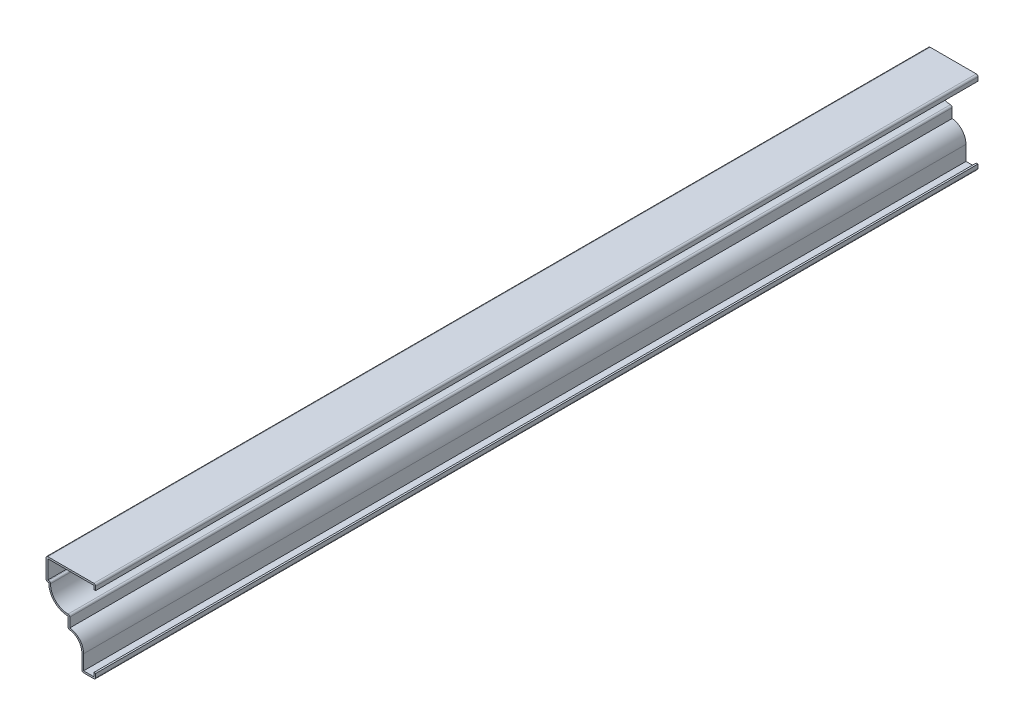
ISO-10303-21;
HEADER;
FILE_DESCRIPTION(('STEP AP214'),'2;1');
FILE_NAME('part.step','',(''),(''),'','','');
FILE_SCHEMA(('AUTOMOTIVE_DESIGN { 1 0 10303 214 1 1 1 1 }'));
ENDSEC;
DATA;
#1=APPLICATION_CONTEXT('core data for automotive mechanical design processes');
#2=APPLICATION_PROTOCOL_DEFINITION('international standard','automotive_design',2000,#1);
#3=PRODUCT_CONTEXT('',#1,'mechanical');
#4=PRODUCT('Part','Part','',(#3));
#5=PRODUCT_RELATED_PRODUCT_CATEGORY('part','',(#4));
#6=PRODUCT_DEFINITION_FORMATION('','',#4);
#7=PRODUCT_DEFINITION_CONTEXT('part definition',#1,'design');
#8=PRODUCT_DEFINITION('design','',#6,#7);
#9=PRODUCT_DEFINITION_SHAPE('','',#8);
#10=(LENGTH_UNIT() NAMED_UNIT(*) SI_UNIT(.MILLI.,.METRE.));
#11=(NAMED_UNIT(*) PLANE_ANGLE_UNIT() SI_UNIT($,.RADIAN.));
#12=(NAMED_UNIT(*) SI_UNIT($,.STERADIAN.) SOLID_ANGLE_UNIT());
#13=UNCERTAINTY_MEASURE_WITH_UNIT(LENGTH_MEASURE(1.E-05),#10,'distance_accuracy_value','');
#14=(GEOMETRIC_REPRESENTATION_CONTEXT(3) GLOBAL_UNCERTAINTY_ASSIGNED_CONTEXT((#13)) GLOBAL_UNIT_ASSIGNED_CONTEXT((#10,
#11,#12)) REPRESENTATION_CONTEXT('',''));
#15=CARTESIAN_POINT('',(0.,0.,0.));
#16=DIRECTION('',(0.,0.,1.));
#17=DIRECTION('',(1.,0.,0.));
#18=AXIS2_PLACEMENT_3D('',#15,#16,#17);
#19=CARTESIAN_POINT('',(-1.016,47.625,-508.));
#20=DIRECTION('',(-1.,0.,0.));
#21=DIRECTION('',(0.,-1.,0.));
#22=AXIS2_PLACEMENT_3D('',#19,#20,#21);
#23=PLANE('',#22);
#24=DIRECTION('',(0.,-1.,0.));
#25=VECTOR('',#24,1.);
#26=CARTESIAN_POINT('',(-1.016,47.625,0.));
#27=LINE('',#26,#25);
#28=CARTESIAN_POINT('',(-1.016,46.609,0.));
#29=VERTEX_POINT('',#28);
#30=CARTESIAN_POINT('',(-1.016,44.45,0.));
#31=VERTEX_POINT('',#30);
#32=EDGE_CURVE('E312',#29,#31,#27,.T.);
#33=ORIENTED_EDGE('',*,*,#32,.F.);
#34=DIRECTION('',(0.,0.,1.));
#35=VECTOR('',#34,1.);
#36=CARTESIAN_POINT('',(-1.016,46.609,-508.));
#37=LINE('',#36,#35);
#38=CARTESIAN_POINT('',(-1.016,46.609,-508.));
#39=VERTEX_POINT('',#38);
#40=EDGE_CURVE('E257',#39,#29,#37,.T.);
#41=ORIENTED_EDGE('',*,*,#40,.F.);
#42=DIRECTION('',(0.,-1.,0.));
#43=VECTOR('',#42,1.);
#44=CARTESIAN_POINT('',(-1.016,47.625,-508.));
#45=LINE('',#44,#43);
#46=CARTESIAN_POINT('',(-1.016,44.45,-508.));
#47=VERTEX_POINT('',#46);
#48=EDGE_CURVE('E238',#39,#47,#45,.T.);
#49=ORIENTED_EDGE('',*,*,#48,.T.);
#50=DIRECTION('',(0.,0.,1.));
#51=VECTOR('',#50,1.);
#52=CARTESIAN_POINT('',(-1.016,44.45,-508.));
#53=LINE('',#52,#51);
#54=EDGE_CURVE('E247',#47,#31,#53,.T.);
#55=ORIENTED_EDGE('',*,*,#54,.T.);
#56=EDGE_LOOP('',(#33,#41,#49,#55));
#57=FACE_BOUND('',#56,.T.);
#58=ADVANCED_FACE('F35',(#57),#23,.T.);
#59=CARTESIAN_POINT('',(-28.575,46.609,-508.));
#60=DIRECTION('',(0.,-1.,0.));
#61=DIRECTION('',(0.,0.,-1.));
#62=AXIS2_PLACEMENT_3D('',#59,#60,#61);
#63=PLANE('',#62);
#64=DIRECTION('',(1.,0.,0.));
#65=VECTOR('',#64,1.);
#66=CARTESIAN_POINT('',(-28.575,46.609,0.));
#67=LINE('',#66,#65);
#68=CARTESIAN_POINT('',(-27.559,46.609,0.));
#69=VERTEX_POINT('',#68);
#70=EDGE_CURVE('E258',#69,#29,#67,.T.);
#71=ORIENTED_EDGE('',*,*,#70,.F.);
#72=DIRECTION('',(0.,0.,1.));
#73=VECTOR('',#72,1.);
#74=CARTESIAN_POINT('',(-27.559,46.609,-508.));
#75=LINE('',#74,#73);
#76=CARTESIAN_POINT('',(-27.559,46.609,-508.));
#77=VERTEX_POINT('',#76);
#78=EDGE_CURVE('E366',#77,#69,#75,.T.);
#79=ORIENTED_EDGE('',*,*,#78,.F.);
#80=DIRECTION('',(1.,0.,0.));
#81=VECTOR('',#80,1.);
#82=CARTESIAN_POINT('',(-28.575,46.609,-508.));
#83=LINE('',#82,#81);
#84=EDGE_CURVE('E255',#77,#39,#83,.T.);
#85=ORIENTED_EDGE('',*,*,#84,.T.);
#86=ORIENTED_EDGE('',*,*,#40,.T.);
#87=EDGE_LOOP('',(#71,#79,#85,#86));
#88=FACE_BOUND('',#87,.T.);
#89=ADVANCED_FACE('F523',(#88),#63,.T.);
#90=CARTESIAN_POINT('',(-27.559,34.925,-508.));
#91=DIRECTION('',(1.,0.,0.));
#92=DIRECTION('',(0.,0.,-1.));
#93=AXIS2_PLACEMENT_3D('',#90,#91,#92);
#94=PLANE('',#93);
#95=DIRECTION('',(0.,1.,0.));
#96=VECTOR('',#95,1.);
#97=CARTESIAN_POINT('',(-27.559,34.925,0.));
#98=LINE('',#97,#96);
#99=CARTESIAN_POINT('',(-27.559,35.941,0.));
#100=VERTEX_POINT('',#99);
#101=EDGE_CURVE('E261',#100,#69,#98,.T.);
#102=ORIENTED_EDGE('',*,*,#101,.F.);
#103=DIRECTION('',(0.,0.,1.));
#104=VECTOR('',#103,1.);
#105=CARTESIAN_POINT('',(-27.559,35.941,-508.));
#106=LINE('',#105,#104);
#107=CARTESIAN_POINT('',(-27.559,35.941,-508.));
#108=VERTEX_POINT('',#107);
#109=EDGE_CURVE('E368',#108,#100,#106,.T.);
#110=ORIENTED_EDGE('',*,*,#109,.F.);
#111=DIRECTION('',(0.,1.,0.));
#112=VECTOR('',#111,1.);
#113=CARTESIAN_POINT('',(-27.559,34.925,-508.));
#114=LINE('',#113,#112);
#115=EDGE_CURVE('E308',#108,#77,#114,.T.);
#116=ORIENTED_EDGE('',*,*,#115,.T.);
#117=ORIENTED_EDGE('',*,*,#78,.T.);
#118=EDGE_LOOP('',(#102,#110,#116,#117));
#119=FACE_BOUND('',#118,.T.);
#120=ADVANCED_FACE('F529',(#119),#94,.T.);
#121=CARTESIAN_POINT('',(-26.9875,35.941,-508.));
#122=DIRECTION('',(0.,1.,0.));
#123=DIRECTION('',(0.,0.,1.));
#124=AXIS2_PLACEMENT_3D('',#121,#122,#123);
#125=PLANE('',#124);
#126=DIRECTION('',(1.,0.,0.));
#127=VECTOR('',#126,1.);
#128=CARTESIAN_POINT('',(-26.9875,35.941,0.));
#129=LINE('',#128,#127);
#130=CARTESIAN_POINT('',(-26.9875,35.941,0.));
#131=VERTEX_POINT('',#130);
#132=EDGE_CURVE('E360',#131,#100,#129,.F.);
#133=ORIENTED_EDGE('',*,*,#132,.F.);
#134=DIRECTION('',(0.,0.,1.));
#135=VECTOR('',#134,1.);
#136=CARTESIAN_POINT('',(-26.9875,35.941,-508.));
#137=LINE('',#136,#135);
#138=CARTESIAN_POINT('',(-26.9875,35.941,-508.));
#139=VERTEX_POINT('',#138);
#140=EDGE_CURVE('E441',#131,#139,#137,.F.);
#141=ORIENTED_EDGE('',*,*,#140,.T.);
#142=DIRECTION('',(1.,0.,0.));
#143=VECTOR('',#142,1.);
#144=CARTESIAN_POINT('',(-26.9875,35.941,-508.));
#145=LINE('',#144,#143);
#146=EDGE_CURVE('E306',#139,#108,#145,.F.);
#147=ORIENTED_EDGE('',*,*,#146,.T.);
#148=ORIENTED_EDGE('',*,*,#109,.T.);
#149=EDGE_LOOP('',(#133,#141,#147,#148));
#150=FACE_BOUND('',#149,.T.);
#151=ADVANCED_FACE('F532',(#150),#125,.T.);
#152=CARTESIAN_POINT('',(-15.875,34.925,-508.));
#153=DIRECTION('',(0.,0.,1.));
#154=DIRECTION('',(1.,0.,0.));
#155=AXIS2_PLACEMENT_3D('',#152,#153,#154);
#156=CYLINDRICAL_SURFACE('',#155,10.0965);
#157=CARTESIAN_POINT('',(-15.875,34.925,-508.));
#158=DIRECTION('',(0.,0.,1.));
#159=DIRECTION('',(1.,0.,0.));
#160=AXIS2_PLACEMENT_3D('',#157,#158,#159);
#161=CIRCLE('',#160,10.0965);
#162=CARTESIAN_POINT('',(-15.875,24.8285,-508.));
#163=VERTEX_POINT('',#162);
#164=CARTESIAN_POINT('',(-25.9715,34.925,-508.));
#165=VERTEX_POINT('',#164);
#166=EDGE_CURVE('E303',#163,#165,#161,.F.);
#167=ORIENTED_EDGE('',*,*,#166,.T.);
#168=DIRECTION('',(0.,0.,1.));
#169=VECTOR('',#168,1.);
#170=CARTESIAN_POINT('',(-25.9715,34.925,-508.));
#171=LINE('',#170,#169);
#172=CARTESIAN_POINT('',(-25.9715,34.925,0.));
#173=VERTEX_POINT('',#172);
#174=EDGE_CURVE('E438',#165,#173,#171,.T.);
#175=ORIENTED_EDGE('',*,*,#174,.T.);
#176=CARTESIAN_POINT('',(-15.875,34.925,0.));
#177=DIRECTION('',(0.,0.,1.));
#178=DIRECTION('',(1.,0.,0.));
#179=AXIS2_PLACEMENT_3D('',#176,#177,#178);
#180=CIRCLE('',#179,10.0965);
#181=CARTESIAN_POINT('',(-15.875,24.8285,0.));
#182=VERTEX_POINT('',#181);
#183=EDGE_CURVE('E357',#182,#173,#180,.F.);
#184=ORIENTED_EDGE('',*,*,#183,.F.);
#185=DIRECTION('',(0.,0.,1.));
#186=VECTOR('',#185,1.);
#187=CARTESIAN_POINT('',(-15.875,24.8285,-508.));
#188=LINE('',#187,#186);
#189=EDGE_CURVE('E436',#182,#163,#188,.F.);
#190=ORIENTED_EDGE('',*,*,#189,.T.);
#191=EDGE_LOOP('',(#167,#175,#184,#190));
#192=FACE_BOUND('',#191,.T.);
#193=ADVANCED_FACE('F540',(#192),#156,.F.);
#194=CARTESIAN_POINT('',(-14.859,17.4625,-508.));
#195=DIRECTION('',(1.,0.,0.));
#196=DIRECTION('',(0.,0.,-1.));
#197=AXIS2_PLACEMENT_3D('',#194,#195,#196);
#198=PLANE('',#197);
#199=DIRECTION('',(0.,1.,0.));
#200=VECTOR('',#199,1.);
#201=CARTESIAN_POINT('',(-14.859,17.4625,-508.));
#202=LINE('',#201,#200);
#203=CARTESIAN_POINT('',(-14.859,18.4206678360874,-508.));
#204=VERTEX_POINT('',#203);
#205=CARTESIAN_POINT('',(-14.859,23.8125,-508.));
#206=VERTEX_POINT('',#205);
#207=EDGE_CURVE('E300',#204,#206,#202,.T.);
#208=ORIENTED_EDGE('',*,*,#207,.T.);
#209=DIRECTION('',(0.,0.,1.));
#210=VECTOR('',#209,1.);
#211=CARTESIAN_POINT('',(-14.859,23.8125,-508.));
#212=LINE('',#211,#210);
#213=CARTESIAN_POINT('',(-14.859,23.8125,0.));
#214=VERTEX_POINT('',#213);
#215=EDGE_CURVE('E445',#206,#214,#212,.T.);
#216=ORIENTED_EDGE('',*,*,#215,.T.);
#217=DIRECTION('',(0.,1.,0.));
#218=VECTOR('',#217,1.);
#219=CARTESIAN_POINT('',(-14.859,17.4625,0.));
#220=LINE('',#219,#218);
#221=CARTESIAN_POINT('',(-14.859,18.4206678360874,0.));
#222=VERTEX_POINT('',#221);
#223=EDGE_CURVE('E354',#222,#214,#220,.T.);
#224=ORIENTED_EDGE('',*,*,#223,.F.);
#225=DIRECTION('',(0.,0.,1.));
#226=VECTOR('',#225,1.);
#227=CARTESIAN_POINT('',(-14.859,18.4206678360874,-508.));
#228=LINE('',#227,#226);
#229=EDGE_CURVE('E371',#204,#222,#228,.T.);
#230=ORIENTED_EDGE('',*,*,#229,.F.);
#231=EDGE_LOOP('',(#208,#216,#224,#230));
#232=FACE_BOUND('',#231,.T.);
#233=ADVANCED_FACE('F549',(#232),#198,.T.);
#234=CARTESIAN_POINT('',(-15.875,9.52500000000001,-508.));
#235=DIRECTION('',(0.,0.,1.));
#236=DIRECTION('',(1.,0.,0.));
#237=AXIS2_PLACEMENT_3D('',#234,#235,#236);
#238=CYLINDRICAL_SURFACE('',#237,8.9535);
#239=CARTESIAN_POINT('',(-15.875,9.52500000000001,0.));
#240=DIRECTION('',(0.,0.,1.));
#241=DIRECTION('',(1.,0.,0.));
#242=AXIS2_PLACEMENT_3D('',#239,#240,#241);
#243=CIRCLE('',#242,8.9535);
#244=CARTESIAN_POINT('',(-6.9215,9.52500000000001,0.));
#245=VERTEX_POINT('',#244);
#246=EDGE_CURVE('E351',#245,#222,#243,.T.);
#247=ORIENTED_EDGE('',*,*,#246,.F.);
#248=DIRECTION('',(0.,0.,1.));
#249=VECTOR('',#248,1.);
#250=CARTESIAN_POINT('',(-6.9215,9.52500000000001,-508.));
#251=LINE('',#250,#249);
#252=CARTESIAN_POINT('',(-6.9215,9.52500000000001,-508.));
#253=VERTEX_POINT('',#252);
#254=EDGE_CURVE('E373',#253,#245,#251,.T.);
#255=ORIENTED_EDGE('',*,*,#254,.F.);
#256=CARTESIAN_POINT('',(-15.875,9.52500000000001,-508.));
#257=DIRECTION('',(0.,0.,1.));
#258=DIRECTION('',(1.,0.,0.));
#259=AXIS2_PLACEMENT_3D('',#256,#257,#258);
#260=CIRCLE('',#259,8.9535);
#261=EDGE_CURVE('E297',#253,#204,#260,.T.);
#262=ORIENTED_EDGE('',*,*,#261,.T.);
#263=ORIENTED_EDGE('',*,*,#229,.T.);
#264=EDGE_LOOP('',(#247,#255,#262,#263));
#265=FACE_BOUND('',#264,.T.);
#266=ADVANCED_FACE('F553',(#265),#238,.T.);
#267=CARTESIAN_POINT('',(-6.9215,0.,-508.));
#268=DIRECTION('',(1.,0.,0.));
#269=DIRECTION('',(0.,1.,0.));
#270=AXIS2_PLACEMENT_3D('',#267,#268,#269);
#271=PLANE('',#270);
#272=DIRECTION('',(0.,1.,0.));
#273=VECTOR('',#272,1.);
#274=CARTESIAN_POINT('',(-6.9215,0.,0.));
#275=LINE('',#274,#273);
#276=CARTESIAN_POINT('',(-6.9215,1.016,0.));
#277=VERTEX_POINT('',#276);
#278=EDGE_CURVE('E348',#277,#245,#275,.T.);
#279=ORIENTED_EDGE('',*,*,#278,.F.);
#280=DIRECTION('',(0.,0.,1.));
#281=VECTOR('',#280,1.);
#282=CARTESIAN_POINT('',(-6.9215,1.016,-508.));
#283=LINE('',#282,#281);
#284=CARTESIAN_POINT('',(-6.9215,1.016,-508.));
#285=VERTEX_POINT('',#284);
#286=EDGE_CURVE('E375',#285,#277,#283,.T.);
#287=ORIENTED_EDGE('',*,*,#286,.F.);
#288=DIRECTION('',(0.,1.,0.));
#289=VECTOR('',#288,1.);
#290=CARTESIAN_POINT('',(-6.9215,0.,-508.));
#291=LINE('',#290,#289);
#292=EDGE_CURVE('E294',#285,#253,#291,.T.);
#293=ORIENTED_EDGE('',*,*,#292,.T.);
#294=ORIENTED_EDGE('',*,*,#254,.T.);
#295=EDGE_LOOP('',(#279,#287,#293,#294));
#296=FACE_BOUND('',#295,.T.);
#297=ADVANCED_FACE('F558',(#296),#271,.T.);
#298=CARTESIAN_POINT('',(0.,1.016,-508.));
#299=DIRECTION('',(0.,1.,0.));
#300=DIRECTION('',(-1.,0.,0.));
#301=AXIS2_PLACEMENT_3D('',#298,#299,#300);
#302=PLANE('',#301);
#303=DIRECTION('',(-1.,0.,0.));
#304=VECTOR('',#303,1.);
#305=CARTESIAN_POINT('',(0.,1.016,0.));
#306=LINE('',#305,#304);
#307=CARTESIAN_POINT('',(-1.016,1.016,0.));
#308=VERTEX_POINT('',#307);
#309=EDGE_CURVE('E345',#308,#277,#306,.T.);
#310=ORIENTED_EDGE('',*,*,#309,.F.);
#311=DIRECTION('',(0.,0.,1.));
#312=VECTOR('',#311,1.);
#313=CARTESIAN_POINT('',(-1.016,1.016,-508.));
#314=LINE('',#313,#312);
#315=CARTESIAN_POINT('',(-1.016,1.016,-508.));
#316=VERTEX_POINT('',#315);
#317=EDGE_CURVE('E377',#316,#308,#314,.T.);
#318=ORIENTED_EDGE('',*,*,#317,.F.);
#319=DIRECTION('',(-1.,0.,0.));
#320=VECTOR('',#319,1.);
#321=CARTESIAN_POINT('',(0.,1.016,-508.));
#322=LINE('',#321,#320);
#323=EDGE_CURVE('E291',#316,#285,#322,.T.);
#324=ORIENTED_EDGE('',*,*,#323,.T.);
#325=ORIENTED_EDGE('',*,*,#286,.T.);
#326=EDGE_LOOP('',(#310,#318,#324,#325));
#327=FACE_BOUND('',#326,.T.);
#328=ADVANCED_FACE('F561',(#327),#302,.T.);
#329=CARTESIAN_POINT('',(-1.016,3.175,-508.));
#330=DIRECTION('',(-1.,0.,0.));
#331=DIRECTION('',(0.,0.,1.));
#332=AXIS2_PLACEMENT_3D('',#329,#330,#331);
#333=PLANE('',#332);
#334=DIRECTION('',(0.,1.,0.));
#335=VECTOR('',#334,1.);
#336=CARTESIAN_POINT('',(-1.016,3.175,0.));
#337=LINE('',#336,#335);
#338=CARTESIAN_POINT('',(-1.016,3.175,0.));
#339=VERTEX_POINT('',#338);
#340=EDGE_CURVE('E342',#339,#308,#337,.F.);
#341=ORIENTED_EDGE('',*,*,#340,.F.);
#342=DIRECTION('',(0.,0.,1.));
#343=VECTOR('',#342,1.);
#344=CARTESIAN_POINT('',(-1.016,3.175,-508.));
#345=LINE('',#344,#343);
#346=CARTESIAN_POINT('',(-1.016,3.175,-508.));
#347=VERTEX_POINT('',#346);
#348=EDGE_CURVE('E379',#347,#339,#345,.T.);
#349=ORIENTED_EDGE('',*,*,#348,.F.);
#350=DIRECTION('',(0.,1.,0.));
#351=VECTOR('',#350,1.);
#352=CARTESIAN_POINT('',(-1.016,3.175,-508.));
#353=LINE('',#352,#351);
#354=EDGE_CURVE('E288',#347,#316,#353,.F.);
#355=ORIENTED_EDGE('',*,*,#354,.T.);
#356=ORIENTED_EDGE('',*,*,#317,.T.);
#357=EDGE_LOOP('',(#341,#349,#355,#356));
#358=FACE_BOUND('',#357,.T.);
#359=ADVANCED_FACE('F565',(#358),#333,.T.);
#360=CARTESIAN_POINT('',(-1.016,3.175,-508.));
#361=DIRECTION('',(0.,-1.,0.));
#362=DIRECTION('',(0.,0.,-1.));
#363=AXIS2_PLACEMENT_3D('',#360,#361,#362);
#364=PLANE('',#363);
#365=DIRECTION('',(1.,0.,0.));
#366=VECTOR('',#365,1.);
#367=CARTESIAN_POINT('',(-1.016,3.175,0.));
#368=LINE('',#367,#366);
#369=CARTESIAN_POINT('',(0.,3.175,0.));
#370=VERTEX_POINT('',#369);
#371=EDGE_CURVE('E340',#339,#370,#368,.T.);
#372=ORIENTED_EDGE('',*,*,#371,.T.);
#373=DIRECTION('',(0.,0.,1.));
#374=VECTOR('',#373,1.);
#375=CARTESIAN_POINT('',(0.,3.175,-508.));
#376=LINE('',#375,#374);
#377=CARTESIAN_POINT('',(0.,3.175,-508.));
#378=VERTEX_POINT('',#377);
#379=EDGE_CURVE('E381',#378,#370,#376,.T.);
#380=ORIENTED_EDGE('',*,*,#379,.F.);
#381=DIRECTION('',(1.,0.,0.));
#382=VECTOR('',#381,1.);
#383=CARTESIAN_POINT('',(-1.016,3.175,-508.));
#384=LINE('',#383,#382);
#385=EDGE_CURVE('E286',#347,#378,#384,.T.);
#386=ORIENTED_EDGE('',*,*,#385,.F.);
#387=ORIENTED_EDGE('',*,*,#348,.T.);
#388=EDGE_LOOP('',(#372,#380,#386,#387));
#389=FACE_BOUND('',#388,.T.);
#390=ADVANCED_FACE('F570',(#389),#364,.F.);
#391=CARTESIAN_POINT('',(0.,3.175,-508.));
#392=DIRECTION('',(-1.,0.,0.));
#393=DIRECTION('',(0.,0.,1.));
#394=AXIS2_PLACEMENT_3D('',#391,#392,#393);
#395=PLANE('',#394);
#396=DIRECTION('',(0.,-1.,0.));
#397=VECTOR('',#396,1.);
#398=CARTESIAN_POINT('',(0.,3.175,0.));
#399=LINE('',#398,#397);
#400=CARTESIAN_POINT('',(0.,1.016,0.));
#401=VERTEX_POINT('',#400);
#402=EDGE_CURVE('E337',#370,#401,#399,.T.);
#403=ORIENTED_EDGE('',*,*,#402,.T.);
#404=DIRECTION('',(0.,0.,1.));
#405=VECTOR('',#404,1.);
#406=CARTESIAN_POINT('',(0.,1.016,-508.));
#407=LINE('',#406,#405);
#408=CARTESIAN_POINT('',(0.,1.016,-508.));
#409=VERTEX_POINT('',#408);
#410=EDGE_CURVE('E11',#401,#409,#407,.F.);
#411=ORIENTED_EDGE('',*,*,#410,.T.);
#412=DIRECTION('',(0.,-1.,0.));
#413=VECTOR('',#412,1.);
#414=CARTESIAN_POINT('',(0.,3.175,-508.));
#415=LINE('',#414,#413);
#416=EDGE_CURVE('E283',#378,#409,#415,.T.);
#417=ORIENTED_EDGE('',*,*,#416,.F.);
#418=ORIENTED_EDGE('',*,*,#379,.T.);
#419=EDGE_LOOP('',(#403,#411,#417,#418));
#420=FACE_BOUND('',#419,.T.);
#421=ADVANCED_FACE('F576',(#420),#395,.F.);
#422=CARTESIAN_POINT('',(0.,0.,-508.));
#423=DIRECTION('',(0.,1.,0.));
#424=DIRECTION('',(-1.,0.,0.));
#425=AXIS2_PLACEMENT_3D('',#422,#423,#424);
#426=PLANE('',#425);
#427=DIRECTION('',(-1.,0.,0.));
#428=VECTOR('',#427,1.);
#429=CARTESIAN_POINT('',(0.,0.,0.));
#430=LINE('',#429,#428);
#431=CARTESIAN_POINT('',(-1.016,0.,0.));
#432=VERTEX_POINT('',#431);
#433=CARTESIAN_POINT('',(-6.9215,0.,0.));
#434=VERTEX_POINT('',#433);
#435=EDGE_CURVE('E334',#432,#434,#430,.T.);
#436=ORIENTED_EDGE('',*,*,#435,.T.);
#437=DIRECTION('',(0.,0.,1.));
#438=VECTOR('',#437,1.);
#439=CARTESIAN_POINT('',(-6.9215,0.,-508.));
#440=LINE('',#439,#438);
#441=CARTESIAN_POINT('',(-6.9215,0.,-508.));
#442=VERTEX_POINT('',#441);
#443=EDGE_CURVE('E43',#434,#442,#440,.F.);
#444=ORIENTED_EDGE('',*,*,#443,.T.);
#445=DIRECTION('',(-1.,0.,0.));
#446=VECTOR('',#445,1.);
#447=CARTESIAN_POINT('',(0.,0.,-508.));
#448=LINE('',#447,#446);
#449=CARTESIAN_POINT('',(-1.016,0.,-508.));
#450=VERTEX_POINT('',#449);
#451=EDGE_CURVE('E280',#450,#442,#448,.T.);
#452=ORIENTED_EDGE('',*,*,#451,.F.);
#453=DIRECTION('',(0.,0.,1.));
#454=VECTOR('',#453,1.);
#455=CARTESIAN_POINT('',(-1.016,0.,-508.));
#456=LINE('',#455,#454);
#457=EDGE_CURVE('E456',#450,#432,#456,.T.);
#458=ORIENTED_EDGE('',*,*,#457,.T.);
#459=EDGE_LOOP('',(#436,#444,#452,#458));
#460=FACE_BOUND('',#459,.T.);
#461=ADVANCED_FACE('F461',(#460),#426,.F.);
#462=CARTESIAN_POINT('',(-7.9375,0.,-508.));
#463=DIRECTION('',(1.,0.,0.));
#464=DIRECTION('',(0.,1.,0.));
#465=AXIS2_PLACEMENT_3D('',#462,#463,#464);
#466=PLANE('',#465);
#467=DIRECTION('',(0.,1.,0.));
#468=VECTOR('',#467,1.);
#469=CARTESIAN_POINT('',(-7.9375,0.,-508.));
#470=LINE('',#469,#468);
#471=CARTESIAN_POINT('',(-7.9375,1.016,-508.));
#472=VERTEX_POINT('',#471);
#473=CARTESIAN_POINT('',(-7.9375,9.52500000000001,-508.));
#474=VERTEX_POINT('',#473);
#475=EDGE_CURVE('E278',#472,#474,#470,.T.);
#476=ORIENTED_EDGE('',*,*,#475,.F.);
#477=DIRECTION('',(0.,0.,1.));
#478=VECTOR('',#477,1.);
#479=CARTESIAN_POINT('',(-7.9375,1.016,-508.));
#480=LINE('',#479,#478);
#481=CARTESIAN_POINT('',(-7.9375,1.016,0.));
#482=VERTEX_POINT('',#481);
#483=EDGE_CURVE('E453',#472,#482,#480,.T.);
#484=ORIENTED_EDGE('',*,*,#483,.T.);
#485=DIRECTION('',(0.,1.,0.));
#486=VECTOR('',#485,1.);
#487=CARTESIAN_POINT('',(-7.9375,0.,0.));
#488=LINE('',#487,#486);
#489=CARTESIAN_POINT('',(-7.9375,9.52500000000001,0.));
#490=VERTEX_POINT('',#489);
#491=EDGE_CURVE('E332',#482,#490,#488,.T.);
#492=ORIENTED_EDGE('',*,*,#491,.T.);
#493=DIRECTION('',(0.,0.,1.));
#494=VECTOR('',#493,1.);
#495=CARTESIAN_POINT('',(-7.9375,9.52500000000001,-508.));
#496=LINE('',#495,#494);
#497=EDGE_CURVE('E384',#474,#490,#496,.T.);
#498=ORIENTED_EDGE('',*,*,#497,.F.);
#499=EDGE_LOOP('',(#476,#484,#492,#498));
#500=FACE_BOUND('',#499,.T.);
#501=ADVANCED_FACE('F472',(#500),#466,.F.);
#502=CARTESIAN_POINT('',(-15.875,9.52500000000001,-508.));
#503=DIRECTION('',(0.,0.,1.));
#504=DIRECTION('',(1.,0.,0.));
#505=AXIS2_PLACEMENT_3D('',#502,#503,#504);
#506=CYLINDRICAL_SURFACE('',#505,7.9375);
#507=CARTESIAN_POINT('',(-15.875,9.52500000000001,0.));
#508=DIRECTION('',(0.,0.,1.));
#509=DIRECTION('',(1.,0.,0.));
#510=AXIS2_PLACEMENT_3D('',#507,#508,#509);
#511=CIRCLE('',#510,7.9375);
#512=CARTESIAN_POINT('',(-14.9742907801418,17.4112303511413,0.));
#513=VERTEX_POINT('',#512);
#514=EDGE_CURVE('E329',#490,#513,#511,.T.);
#515=ORIENTED_EDGE('',*,*,#514,.T.);
#516=DIRECTION('',(0.,0.,1.));
#517=VECTOR('',#516,1.);
#518=CARTESIAN_POINT('',(-14.9742907801418,17.4112303511413,-508.));
#519=LINE('',#518,#517);
#520=CARTESIAN_POINT('',(-14.9742907801418,17.4112303511413,-508.));
#521=VERTEX_POINT('',#520);
#522=EDGE_CURVE('E451',#513,#521,#519,.F.);
#523=ORIENTED_EDGE('',*,*,#522,.T.);
#524=CARTESIAN_POINT('',(-15.875,9.52500000000001,-508.));
#525=DIRECTION('',(0.,0.,1.));
#526=DIRECTION('',(1.,0.,0.));
#527=AXIS2_PLACEMENT_3D('',#524,#525,#526);
#528=CIRCLE('',#527,7.9375);
#529=EDGE_CURVE('E275',#474,#521,#528,.T.);
#530=ORIENTED_EDGE('',*,*,#529,.F.);
#531=ORIENTED_EDGE('',*,*,#497,.T.);
#532=EDGE_LOOP('',(#515,#523,#530,#531));
#533=FACE_BOUND('',#532,.T.);
#534=ADVANCED_FACE('F481',(#533),#506,.F.);
#535=CARTESIAN_POINT('',(-15.875,17.4625,-508.));
#536=DIRECTION('',(1.,0.,0.));
#537=DIRECTION('',(0.,0.,-1.));
#538=AXIS2_PLACEMENT_3D('',#535,#536,#537);
#539=PLANE('',#538);
#540=DIRECTION('',(0.,1.,0.));
#541=VECTOR('',#540,1.);
#542=CARTESIAN_POINT('',(-15.875,17.4625,-508.));
#543=LINE('',#542,#541);
#544=CARTESIAN_POINT('',(-15.875,18.4206678360874,-508.));
#545=VERTEX_POINT('',#544);
#546=CARTESIAN_POINT('',(-15.875,23.8125,-508.));
#547=VERTEX_POINT('',#546);
#548=EDGE_CURVE('E273',#545,#547,#543,.T.);
#549=ORIENTED_EDGE('',*,*,#548,.F.);
#550=DIRECTION('',(0.,0.,1.));
#551=VECTOR('',#550,1.);
#552=CARTESIAN_POINT('',(-15.875,18.4206678360874,-508.));
#553=LINE('',#552,#551);
#554=CARTESIAN_POINT('',(-15.875,18.4206678360874,0.));
#555=VERTEX_POINT('',#554);
#556=EDGE_CURVE('E448',#545,#555,#553,.T.);
#557=ORIENTED_EDGE('',*,*,#556,.T.);
#558=DIRECTION('',(0.,1.,0.));
#559=VECTOR('',#558,1.);
#560=CARTESIAN_POINT('',(-15.875,17.4625,0.));
#561=LINE('',#560,#559);
#562=CARTESIAN_POINT('',(-15.875,23.8125,0.));
#563=VERTEX_POINT('',#562);
#564=EDGE_CURVE('E327',#555,#563,#561,.T.);
#565=ORIENTED_EDGE('',*,*,#564,.T.);
#566=DIRECTION('',(0.,0.,1.));
#567=VECTOR('',#566,1.);
#568=CARTESIAN_POINT('',(-15.875,23.8125,-508.));
#569=LINE('',#568,#567);
#570=EDGE_CURVE('E387',#547,#563,#569,.T.);
#571=ORIENTED_EDGE('',*,*,#570,.F.);
#572=EDGE_LOOP('',(#549,#557,#565,#571));
#573=FACE_BOUND('',#572,.T.);
#574=ADVANCED_FACE('F490',(#573),#539,.F.);
#575=CARTESIAN_POINT('',(-15.875,34.925,-508.));
#576=DIRECTION('',(0.,0.,1.));
#577=DIRECTION('',(1.,0.,0.));
#578=AXIS2_PLACEMENT_3D('',#575,#576,#577);
#579=CYLINDRICAL_SURFACE('',#578,11.1125);
#580=CARTESIAN_POINT('',(-15.875,34.925,0.));
#581=DIRECTION('',(0.,0.,-1.));
#582=DIRECTION('',(-1.,0.,0.));
#583=AXIS2_PLACEMENT_3D('',#580,#581,#582);
#584=CIRCLE('',#583,11.1125);
#585=CARTESIAN_POINT('',(-26.9875,34.925,0.));
#586=VERTEX_POINT('',#585);
#587=EDGE_CURVE('E325',#563,#586,#584,.T.);
#588=ORIENTED_EDGE('',*,*,#587,.T.);
#589=DIRECTION('',(0.,0.,1.));
#590=VECTOR('',#589,1.);
#591=CARTESIAN_POINT('',(-26.9875,34.925,-508.));
#592=LINE('',#591,#590);
#593=CARTESIAN_POINT('',(-26.9875,34.925,-508.));
#594=VERTEX_POINT('',#593);
#595=EDGE_CURVE('E390',#594,#586,#592,.T.);
#596=ORIENTED_EDGE('',*,*,#595,.F.);
#597=CARTESIAN_POINT('',(-15.875,34.925,-508.));
#598=DIRECTION('',(0.,0.,-1.));
#599=DIRECTION('',(-1.,0.,0.));
#600=AXIS2_PLACEMENT_3D('',#597,#598,#599);
#601=CIRCLE('',#600,11.1125);
#602=EDGE_CURVE('E271',#547,#594,#601,.T.);
#603=ORIENTED_EDGE('',*,*,#602,.F.);
#604=ORIENTED_EDGE('',*,*,#570,.T.);
#605=EDGE_LOOP('',(#588,#596,#603,#604));
#606=FACE_BOUND('',#605,.T.);
#607=ADVANCED_FACE('F495',(#606),#579,.T.);
#608=CARTESIAN_POINT('',(-26.9875,34.925,-508.));
#609=DIRECTION('',(0.,1.,0.));
#610=DIRECTION('',(0.,0.,1.));
#611=AXIS2_PLACEMENT_3D('',#608,#609,#610);
#612=PLANE('',#611);
#613=DIRECTION('',(-1.,0.,0.));
#614=VECTOR('',#613,1.);
#615=CARTESIAN_POINT('',(-26.9875,34.925,0.));
#616=LINE('',#615,#614);
#617=CARTESIAN_POINT('',(-27.559,34.925,0.));
#618=VERTEX_POINT('',#617);
#619=EDGE_CURVE('E322',#586,#618,#616,.T.);
#620=ORIENTED_EDGE('',*,*,#619,.T.);
#621=DIRECTION('',(0.,0.,1.));
#622=VECTOR('',#621,1.);
#623=CARTESIAN_POINT('',(-27.559,34.925,-508.));
#624=LINE('',#623,#622);
#625=CARTESIAN_POINT('',(-27.559,34.925,-508.));
#626=VERTEX_POINT('',#625);
#627=EDGE_CURVE('E443',#618,#626,#624,.F.);
#628=ORIENTED_EDGE('',*,*,#627,.T.);
#629=DIRECTION('',(-1.,0.,0.));
#630=VECTOR('',#629,1.);
#631=CARTESIAN_POINT('',(-26.9875,34.925,-508.));
#632=LINE('',#631,#630);
#633=EDGE_CURVE('E269',#594,#626,#632,.T.);
#634=ORIENTED_EDGE('',*,*,#633,.F.);
#635=ORIENTED_EDGE('',*,*,#595,.T.);
#636=EDGE_LOOP('',(#620,#628,#634,#635));
#637=FACE_BOUND('',#636,.T.);
#638=ADVANCED_FACE('F694',(#637),#612,.F.);
#639=CARTESIAN_POINT('',(-28.575,34.925,-508.));
#640=DIRECTION('',(1.,0.,0.));
#641=DIRECTION('',(0.,0.,-1.));
#642=AXIS2_PLACEMENT_3D('',#639,#640,#641);
#643=PLANE('',#642);
#644=DIRECTION('',(0.,1.,0.));
#645=VECTOR('',#644,1.);
#646=CARTESIAN_POINT('',(-28.575,34.925,0.));
#647=LINE('',#646,#645);
#648=CARTESIAN_POINT('',(-28.575,35.941,0.));
#649=VERTEX_POINT('',#648);
#650=CARTESIAN_POINT('',(-28.575,46.609,0.));
#651=VERTEX_POINT('',#650);
#652=EDGE_CURVE('E320',#649,#651,#647,.T.);
#653=ORIENTED_EDGE('',*,*,#652,.T.);
#654=DIRECTION('',(0.,0.,1.));
#655=VECTOR('',#654,1.);
#656=CARTESIAN_POINT('',(-28.575,46.609,-508.));
#657=LINE('',#656,#655);
#658=CARTESIAN_POINT('',(-28.575,46.609,-508.));
#659=VERTEX_POINT('',#658);
#660=EDGE_CURVE('E50',#651,#659,#657,.F.);
#661=ORIENTED_EDGE('',*,*,#660,.T.);
#662=DIRECTION('',(0.,1.,0.));
#663=VECTOR('',#662,1.);
#664=CARTESIAN_POINT('',(-28.575,34.925,-508.));
#665=LINE('',#664,#663);
#666=CARTESIAN_POINT('',(-28.575,35.941,-508.));
#667=VERTEX_POINT('',#666);
#668=EDGE_CURVE('E267',#667,#659,#665,.T.);
#669=ORIENTED_EDGE('',*,*,#668,.F.);
#670=DIRECTION('',(0.,0.,1.));
#671=VECTOR('',#670,1.);
#672=CARTESIAN_POINT('',(-28.575,35.941,-508.));
#673=LINE('',#672,#671);
#674=EDGE_CURVE('E432',#667,#649,#673,.T.);
#675=ORIENTED_EDGE('',*,*,#674,.T.);
#676=EDGE_LOOP('',(#653,#661,#669,#675));
#677=FACE_BOUND('',#676,.T.);
#678=ADVANCED_FACE('F503',(#677),#643,.F.);
#679=CARTESIAN_POINT('',(-28.575,47.625,-508.));
#680=DIRECTION('',(0.,-1.,0.));
#681=DIRECTION('',(0.,0.,-1.));
#682=AXIS2_PLACEMENT_3D('',#679,#680,#681);
#683=PLANE('',#682);
#684=DIRECTION('',(1.,0.,0.));
#685=VECTOR('',#684,1.);
#686=CARTESIAN_POINT('',(-28.575,47.625,0.));
#687=LINE('',#686,#685);
#688=CARTESIAN_POINT('',(-27.559,47.625,0.));
#689=VERTEX_POINT('',#688);
#690=CARTESIAN_POINT('',(-1.016,47.625,0.));
#691=VERTEX_POINT('',#690);
#692=EDGE_CURVE('E317',#689,#691,#687,.T.);
#693=ORIENTED_EDGE('',*,*,#692,.T.);
#694=DIRECTION('',(0.,0.,1.));
#695=VECTOR('',#694,1.);
#696=CARTESIAN_POINT('',(-1.016,47.625,-508.));
#697=LINE('',#696,#695);
#698=CARTESIAN_POINT('',(-1.016,47.625,-508.));
#699=VERTEX_POINT('',#698);
#700=EDGE_CURVE('E415',#691,#699,#697,.F.);
#701=ORIENTED_EDGE('',*,*,#700,.T.);
#702=DIRECTION('',(1.,0.,0.));
#703=VECTOR('',#702,1.);
#704=CARTESIAN_POINT('',(-28.575,47.625,-508.));
#705=LINE('',#704,#703);
#706=CARTESIAN_POINT('',(-27.559,47.625,-508.));
#707=VERTEX_POINT('',#706);
#708=EDGE_CURVE('E265',#707,#699,#705,.T.);
#709=ORIENTED_EDGE('',*,*,#708,.F.);
#710=DIRECTION('',(0.,0.,1.));
#711=VECTOR('',#710,1.);
#712=CARTESIAN_POINT('',(-27.559,47.625,-508.));
#713=LINE('',#712,#711);
#714=EDGE_CURVE('E412',#707,#689,#713,.T.);
#715=ORIENTED_EDGE('',*,*,#714,.T.);
#716=EDGE_LOOP('',(#693,#701,#709,#715));
#717=FACE_BOUND('',#716,.T.);
#718=ADVANCED_FACE('F512',(#717),#683,.F.);
#719=CARTESIAN_POINT('',(0.,47.625,-508.));
#720=DIRECTION('',(-1.,0.,0.));
#721=DIRECTION('',(0.,-1.,0.));
#722=AXIS2_PLACEMENT_3D('',#719,#720,#721);
#723=PLANE('',#722);
#724=DIRECTION('',(0.,-1.,0.));
#725=VECTOR('',#724,1.);
#726=CARTESIAN_POINT('',(0.,47.625,-508.));
#727=LINE('',#726,#725);
#728=CARTESIAN_POINT('',(0.,46.609,-508.));
#729=VERTEX_POINT('',#728);
#730=CARTESIAN_POINT('',(0.,44.45,-508.));
#731=VERTEX_POINT('',#730);
#732=EDGE_CURVE('E241',#729,#731,#727,.T.);
#733=ORIENTED_EDGE('',*,*,#732,.F.);
#734=DIRECTION('',(0.,0.,1.));
#735=VECTOR('',#734,1.);
#736=CARTESIAN_POINT('',(0.,46.609,-508.));
#737=LINE('',#736,#735);
#738=CARTESIAN_POINT('',(0.,46.609,0.));
#739=VERTEX_POINT('',#738);
#740=EDGE_CURVE('E365',#729,#739,#737,.T.);
#741=ORIENTED_EDGE('',*,*,#740,.T.);
#742=DIRECTION('',(0.,-1.,0.));
#743=VECTOR('',#742,1.);
#744=CARTESIAN_POINT('',(0.,47.625,0.));
#745=LINE('',#744,#743);
#746=CARTESIAN_POINT('',(0.,44.45,0.));
#747=VERTEX_POINT('',#746);
#748=EDGE_CURVE('E315',#739,#747,#745,.T.);
#749=ORIENTED_EDGE('',*,*,#748,.T.);
#750=DIRECTION('',(0.,0.,1.));
#751=VECTOR('',#750,1.);
#752=CARTESIAN_POINT('',(0.,44.45,-508.));
#753=LINE('',#752,#751);
#754=EDGE_CURVE('E254',#731,#747,#753,.T.);
#755=ORIENTED_EDGE('',*,*,#754,.F.);
#756=EDGE_LOOP('',(#733,#741,#749,#755));
#757=FACE_BOUND('',#756,.T.);
#758=ADVANCED_FACE('F519',(#757),#723,.F.);
#759=CARTESIAN_POINT('',(0.,44.45,-508.));
#760=DIRECTION('',(0.,1.,0.));
#761=DIRECTION('',(0.,0.,1.));
#762=AXIS2_PLACEMENT_3D('',#759,#760,#761);
#763=PLANE('',#762);
#764=DIRECTION('',(-1.,0.,0.));
#765=VECTOR('',#764,1.);
#766=CARTESIAN_POINT('',(0.,44.45,0.));
#767=LINE('',#766,#765);
#768=EDGE_CURVE('E250',#747,#31,#767,.T.);
#769=ORIENTED_EDGE('',*,*,#768,.T.);
#770=ORIENTED_EDGE('',*,*,#54,.F.);
#771=DIRECTION('',(-1.,0.,0.));
#772=VECTOR('',#771,1.);
#773=CARTESIAN_POINT('',(0.,44.45,-508.));
#774=LINE('',#773,#772);
#775=EDGE_CURVE('E232',#731,#47,#774,.T.);
#776=ORIENTED_EDGE('',*,*,#775,.F.);
#777=ORIENTED_EDGE('',*,*,#754,.T.);
#778=EDGE_LOOP('',(#769,#770,#776,#777));
#779=FACE_BOUND('',#778,.T.);
#780=ADVANCED_FACE('F248',(#779),#763,.F.);
#781=CARTESIAN_POINT('',(-15.875,34.925,-508.));
#782=DIRECTION('',(0.,0.,-1.));
#783=DIRECTION('',(-1.,0.,0.));
#784=AXIS2_PLACEMENT_3D('',#781,#782,#783);
#785=PLANE('',#784);
#786=ORIENTED_EDGE('',*,*,#708,.T.);
#787=CARTESIAN_POINT('',(-1.016,46.609,-508.));
#788=DIRECTION('',(0.,0.,-1.));
#789=DIRECTION('',(-1.,0.,0.));
#790=AXIS2_PLACEMENT_3D('',#787,#788,#789);
#791=CIRCLE('',#790,1.016);
#792=EDGE_CURVE('E430',#699,#729,#791,.T.);
#793=ORIENTED_EDGE('',*,*,#792,.T.);
#794=ORIENTED_EDGE('',*,*,#732,.T.);
#795=ORIENTED_EDGE('',*,*,#775,.T.);
#796=ORIENTED_EDGE('',*,*,#48,.F.);
#797=ORIENTED_EDGE('',*,*,#84,.F.);
#798=ORIENTED_EDGE('',*,*,#115,.F.);
#799=ORIENTED_EDGE('',*,*,#146,.F.);
#800=CARTESIAN_POINT('',(-26.9875,34.925,-508.));
#801=DIRECTION('',(0.,0.,-1.));
#802=DIRECTION('',(-1.,0.,0.));
#803=AXIS2_PLACEMENT_3D('',#800,#801,#802);
#804=CIRCLE('',#803,1.016);
#805=EDGE_CURVE('E426',#139,#165,#804,.T.);
#806=ORIENTED_EDGE('',*,*,#805,.T.);
#807=ORIENTED_EDGE('',*,*,#166,.F.);
#808=CARTESIAN_POINT('',(-15.875,23.8125,-508.));
#809=DIRECTION('',(0.,0.,-1.));
#810=DIRECTION('',(-1.,0.,0.));
#811=AXIS2_PLACEMENT_3D('',#808,#809,#810);
#812=CIRCLE('',#811,1.016);
#813=EDGE_CURVE('E423',#163,#206,#812,.T.);
#814=ORIENTED_EDGE('',*,*,#813,.T.);
#815=ORIENTED_EDGE('',*,*,#207,.F.);
#816=ORIENTED_EDGE('',*,*,#261,.F.);
#817=ORIENTED_EDGE('',*,*,#292,.F.);
#818=ORIENTED_EDGE('',*,*,#323,.F.);
#819=ORIENTED_EDGE('',*,*,#354,.F.);
#820=ORIENTED_EDGE('',*,*,#385,.T.);
#821=ORIENTED_EDGE('',*,*,#416,.T.);
#822=CARTESIAN_POINT('',(-1.016,1.016,-508.));
#823=DIRECTION('',(0.,0.,-1.));
#824=DIRECTION('',(-1.,0.,0.));
#825=AXIS2_PLACEMENT_3D('',#822,#823,#824);
#826=CIRCLE('',#825,1.016);
#827=EDGE_CURVE('E417',#409,#450,#826,.T.);
#828=ORIENTED_EDGE('',*,*,#827,.T.);
#829=ORIENTED_EDGE('',*,*,#451,.T.);
#830=CARTESIAN_POINT('',(-6.9215,1.016,-508.));
#831=DIRECTION('',(0.,0.,-1.));
#832=DIRECTION('',(-1.,0.,0.));
#833=AXIS2_PLACEMENT_3D('',#830,#831,#832);
#834=CIRCLE('',#833,1.016);
#835=EDGE_CURVE('E419',#442,#472,#834,.T.);
#836=ORIENTED_EDGE('',*,*,#835,.T.);
#837=ORIENTED_EDGE('',*,*,#475,.T.);
#838=ORIENTED_EDGE('',*,*,#529,.T.);
#839=CARTESIAN_POINT('',(-14.859,18.4206678360874,-508.));
#840=DIRECTION('',(0.,0.,-1.));
#841=DIRECTION('',(-1.,0.,0.));
#842=AXIS2_PLACEMENT_3D('',#839,#840,#841);
#843=CIRCLE('',#842,1.016);
#844=EDGE_CURVE('E421',#521,#545,#843,.T.);
#845=ORIENTED_EDGE('',*,*,#844,.T.);
#846=ORIENTED_EDGE('',*,*,#548,.T.);
#847=ORIENTED_EDGE('',*,*,#602,.T.);
#848=ORIENTED_EDGE('',*,*,#633,.T.);
#849=CARTESIAN_POINT('',(-27.559,35.941,-508.));
#850=DIRECTION('',(0.,0.,-1.));
#851=DIRECTION('',(-1.,0.,0.));
#852=AXIS2_PLACEMENT_3D('',#849,#850,#851);
#853=CIRCLE('',#852,1.016);
#854=EDGE_CURVE('E57',#626,#667,#853,.T.);
#855=ORIENTED_EDGE('',*,*,#854,.T.);
#856=ORIENTED_EDGE('',*,*,#668,.T.);
#857=CARTESIAN_POINT('',(-27.559,46.609,-508.));
#858=DIRECTION('',(0.,0.,-1.));
#859=DIRECTION('',(-1.,0.,0.));
#860=AXIS2_PLACEMENT_3D('',#857,#858,#859);
#861=CIRCLE('',#860,1.016);
#862=EDGE_CURVE('E428',#659,#707,#861,.T.);
#863=ORIENTED_EDGE('',*,*,#862,.T.);
#864=EDGE_LOOP('',(#786,#793,#794,#795,#796,#797,#798,#799,#806,#807,#814,#815,#816,#817,#818,
#819,#820,#821,#828,#829,#836,#837,#838,#845,#846,#847,#848,#855,#856,#863));
#865=FACE_BOUND('',#864,.T.);
#866=ADVANCED_FACE('F235',(#865),#785,.T.);
#867=CARTESIAN_POINT('',(-15.875,34.925,0.));
#868=DIRECTION('',(0.,0.,-1.));
#869=DIRECTION('',(-1.,0.,0.));
#870=AXIS2_PLACEMENT_3D('',#867,#868,#869);
#871=PLANE('',#870);
#872=ORIENTED_EDGE('',*,*,#748,.F.);
#873=CARTESIAN_POINT('',(-1.016,46.609,0.));
#874=DIRECTION('',(0.,0.,-1.));
#875=DIRECTION('',(-1.,0.,0.));
#876=AXIS2_PLACEMENT_3D('',#873,#874,#875);
#877=CIRCLE('',#876,1.016);
#878=EDGE_CURVE('E410',#739,#691,#877,.F.);
#879=ORIENTED_EDGE('',*,*,#878,.T.);
#880=ORIENTED_EDGE('',*,*,#692,.F.);
#881=CARTESIAN_POINT('',(-27.559,46.609,0.));
#882=DIRECTION('',(0.,0.,-1.));
#883=DIRECTION('',(-1.,0.,0.));
#884=AXIS2_PLACEMENT_3D('',#881,#882,#883);
#885=CIRCLE('',#884,1.016);
#886=EDGE_CURVE('E408',#689,#651,#885,.F.);
#887=ORIENTED_EDGE('',*,*,#886,.T.);
#888=ORIENTED_EDGE('',*,*,#652,.F.);
#889=CARTESIAN_POINT('',(-27.559,35.941,0.));
#890=DIRECTION('',(0.,0.,-1.));
#891=DIRECTION('',(-1.,0.,0.));
#892=AXIS2_PLACEMENT_3D('',#889,#890,#891);
#893=CIRCLE('',#892,1.016);
#894=EDGE_CURVE('E404',#649,#618,#893,.F.);
#895=ORIENTED_EDGE('',*,*,#894,.T.);
#896=ORIENTED_EDGE('',*,*,#619,.F.);
#897=ORIENTED_EDGE('',*,*,#587,.F.);
#898=ORIENTED_EDGE('',*,*,#564,.F.);
#899=CARTESIAN_POINT('',(-14.859,18.4206678360874,0.));
#900=DIRECTION('',(0.,0.,-1.));
#901=DIRECTION('',(-1.,0.,0.));
#902=AXIS2_PLACEMENT_3D('',#899,#900,#901);
#903=CIRCLE('',#902,1.016);
#904=EDGE_CURVE('E400',#555,#513,#903,.F.);
#905=ORIENTED_EDGE('',*,*,#904,.T.);
#906=ORIENTED_EDGE('',*,*,#514,.F.);
#907=ORIENTED_EDGE('',*,*,#491,.F.);
#908=CARTESIAN_POINT('',(-6.9215,1.016,0.));
#909=DIRECTION('',(0.,0.,-1.));
#910=DIRECTION('',(-1.,0.,0.));
#911=AXIS2_PLACEMENT_3D('',#908,#909,#910);
#912=CIRCLE('',#911,1.016);
#913=EDGE_CURVE('E398',#482,#434,#912,.F.);
#914=ORIENTED_EDGE('',*,*,#913,.T.);
#915=ORIENTED_EDGE('',*,*,#435,.F.);
#916=CARTESIAN_POINT('',(-1.016,1.016,0.));
#917=DIRECTION('',(0.,0.,-1.));
#918=DIRECTION('',(-1.,0.,0.));
#919=AXIS2_PLACEMENT_3D('',#916,#917,#918);
#920=CIRCLE('',#919,1.016);
#921=EDGE_CURVE('E396',#432,#401,#920,.F.);
#922=ORIENTED_EDGE('',*,*,#921,.T.);
#923=ORIENTED_EDGE('',*,*,#402,.F.);
#924=ORIENTED_EDGE('',*,*,#371,.F.);
#925=ORIENTED_EDGE('',*,*,#340,.T.);
#926=ORIENTED_EDGE('',*,*,#309,.T.);
#927=ORIENTED_EDGE('',*,*,#278,.T.);
#928=ORIENTED_EDGE('',*,*,#246,.T.);
#929=ORIENTED_EDGE('',*,*,#223,.T.);
#930=CARTESIAN_POINT('',(-15.875,23.8125,0.));
#931=DIRECTION('',(0.,0.,-1.));
#932=DIRECTION('',(-1.,0.,0.));
#933=AXIS2_PLACEMENT_3D('',#930,#931,#932);
#934=CIRCLE('',#933,1.016);
#935=EDGE_CURVE('E402',#214,#182,#934,.F.);
#936=ORIENTED_EDGE('',*,*,#935,.T.);
#937=ORIENTED_EDGE('',*,*,#183,.T.);
#938=CARTESIAN_POINT('',(-26.9875,34.925,0.));
#939=DIRECTION('',(0.,0.,-1.));
#940=DIRECTION('',(-1.,0.,0.));
#941=AXIS2_PLACEMENT_3D('',#938,#939,#940);
#942=CIRCLE('',#941,1.016);
#943=EDGE_CURVE('E406',#173,#131,#942,.F.);
#944=ORIENTED_EDGE('',*,*,#943,.T.);
#945=ORIENTED_EDGE('',*,*,#132,.T.);
#946=ORIENTED_EDGE('',*,*,#101,.T.);
#947=ORIENTED_EDGE('',*,*,#70,.T.);
#948=ORIENTED_EDGE('',*,*,#32,.T.);
#949=ORIENTED_EDGE('',*,*,#768,.F.);
#950=EDGE_LOOP('',(#872,#879,#880,#887,#888,#895,#896,#897,#898,#905,#906,#907,#914,#915,#922,
#923,#924,#925,#926,#927,#928,#929,#936,#937,#944,#945,#946,#947,#948,#949));
#951=FACE_BOUND('',#950,.T.);
#952=ADVANCED_FACE('F477',(#951),#871,.F.);
#953=CARTESIAN_POINT('',(-1.016,46.609,-508.));
#954=DIRECTION('',(0.,0.,1.));
#955=DIRECTION('',(1.,0.,0.));
#956=AXIS2_PLACEMENT_3D('',#953,#954,#955);
#957=CYLINDRICAL_SURFACE('',#956,1.016);
#958=ORIENTED_EDGE('',*,*,#792,.F.);
#959=ORIENTED_EDGE('',*,*,#700,.F.);
#960=ORIENTED_EDGE('',*,*,#878,.F.);
#961=ORIENTED_EDGE('',*,*,#740,.F.);
#962=EDGE_LOOP('',(#958,#959,#960,#961));
#963=FACE_BOUND('',#962,.T.);
#964=ADVANCED_FACE('F517',(#963),#957,.T.);
#965=CARTESIAN_POINT('',(-27.559,46.609,-508.));
#966=DIRECTION('',(0.,0.,1.));
#967=DIRECTION('',(1.,0.,0.));
#968=AXIS2_PLACEMENT_3D('',#965,#966,#967);
#969=CYLINDRICAL_SURFACE('',#968,1.016);
#970=ORIENTED_EDGE('',*,*,#862,.F.);
#971=ORIENTED_EDGE('',*,*,#660,.F.);
#972=ORIENTED_EDGE('',*,*,#886,.F.);
#973=ORIENTED_EDGE('',*,*,#714,.F.);
#974=EDGE_LOOP('',(#970,#971,#972,#973));
#975=FACE_BOUND('',#974,.T.);
#976=ADVANCED_FACE('F509',(#975),#969,.T.);
#977=CARTESIAN_POINT('',(-26.9875,34.925,-508.));
#978=DIRECTION('',(0.,0.,1.));
#979=DIRECTION('',(1.,0.,0.));
#980=AXIS2_PLACEMENT_3D('',#977,#978,#979);
#981=CYLINDRICAL_SURFACE('',#980,1.016);
#982=ORIENTED_EDGE('',*,*,#805,.F.);
#983=ORIENTED_EDGE('',*,*,#140,.F.);
#984=ORIENTED_EDGE('',*,*,#943,.F.);
#985=ORIENTED_EDGE('',*,*,#174,.F.);
#986=EDGE_LOOP('',(#982,#983,#984,#985));
#987=FACE_BOUND('',#986,.T.);
#988=ADVANCED_FACE('F535',(#987),#981,.T.);
#989=CARTESIAN_POINT('',(-27.559,35.941,-508.));
#990=DIRECTION('',(0.,0.,1.));
#991=DIRECTION('',(1.,0.,0.));
#992=AXIS2_PLACEMENT_3D('',#989,#990,#991);
#993=CYLINDRICAL_SURFACE('',#992,1.016);
#994=ORIENTED_EDGE('',*,*,#854,.F.);
#995=ORIENTED_EDGE('',*,*,#627,.F.);
#996=ORIENTED_EDGE('',*,*,#894,.F.);
#997=ORIENTED_EDGE('',*,*,#674,.F.);
#998=EDGE_LOOP('',(#994,#995,#996,#997));
#999=FACE_BOUND('',#998,.T.);
#1000=ADVANCED_FACE('F501',(#999),#993,.T.);
#1001=CARTESIAN_POINT('',(-15.875,23.8125,-508.));
#1002=DIRECTION('',(0.,0.,1.));
#1003=DIRECTION('',(1.,0.,0.));
#1004=AXIS2_PLACEMENT_3D('',#1001,#1002,#1003);
#1005=CYLINDRICAL_SURFACE('',#1004,1.016);
#1006=ORIENTED_EDGE('',*,*,#813,.F.);
#1007=ORIENTED_EDGE('',*,*,#189,.F.);
#1008=ORIENTED_EDGE('',*,*,#935,.F.);
#1009=ORIENTED_EDGE('',*,*,#215,.F.);
#1010=EDGE_LOOP('',(#1006,#1007,#1008,#1009));
#1011=FACE_BOUND('',#1010,.T.);
#1012=ADVANCED_FACE('F544',(#1011),#1005,.T.);
#1013=CARTESIAN_POINT('',(-14.859,18.4206678360874,-508.));
#1014=DIRECTION('',(0.,0.,1.));
#1015=DIRECTION('',(1.,0.,0.));
#1016=AXIS2_PLACEMENT_3D('',#1013,#1014,#1015);
#1017=CYLINDRICAL_SURFACE('',#1016,1.016);
#1018=ORIENTED_EDGE('',*,*,#844,.F.);
#1019=ORIENTED_EDGE('',*,*,#522,.F.);
#1020=ORIENTED_EDGE('',*,*,#904,.F.);
#1021=ORIENTED_EDGE('',*,*,#556,.F.);
#1022=EDGE_LOOP('',(#1018,#1019,#1020,#1021));
#1023=FACE_BOUND('',#1022,.T.);
#1024=ADVANCED_FACE('F485',(#1023),#1017,.T.);
#1025=CARTESIAN_POINT('',(-6.9215,1.016,-508.));
#1026=DIRECTION('',(0.,0.,1.));
#1027=DIRECTION('',(1.,0.,0.));
#1028=AXIS2_PLACEMENT_3D('',#1025,#1026,#1027);
#1029=CYLINDRICAL_SURFACE('',#1028,1.016);
#1030=ORIENTED_EDGE('',*,*,#835,.F.);
#1031=ORIENTED_EDGE('',*,*,#443,.F.);
#1032=ORIENTED_EDGE('',*,*,#913,.F.);
#1033=ORIENTED_EDGE('',*,*,#483,.F.);
#1034=EDGE_LOOP('',(#1030,#1031,#1032,#1033));
#1035=FACE_BOUND('',#1034,.T.);
#1036=ADVANCED_FACE('F469',(#1035),#1029,.T.);
#1037=CARTESIAN_POINT('',(-1.016,1.016,-508.));
#1038=DIRECTION('',(0.,0.,1.));
#1039=DIRECTION('',(1.,0.,0.));
#1040=AXIS2_PLACEMENT_3D('',#1037,#1038,#1039);
#1041=CYLINDRICAL_SURFACE('',#1040,1.016);
#1042=ORIENTED_EDGE('',*,*,#827,.F.);
#1043=ORIENTED_EDGE('',*,*,#410,.F.);
#1044=ORIENTED_EDGE('',*,*,#921,.F.);
#1045=ORIENTED_EDGE('',*,*,#457,.F.);
#1046=EDGE_LOOP('',(#1042,#1043,#1044,#1045));
#1047=FACE_BOUND('',#1046,.T.);
#1048=ADVANCED_FACE('F37',(#1047),#1041,.T.);
#1049=CLOSED_SHELL('',(#58,#89,#120,#151,#193,#233,#266,#297,#328,#359,#390,#421,#461,#501,#534,
#574,#607,#638,#678,#718,#758,#780,#866,#952,#964,#976,#988,#1000,#1012,#1024,#1036,#1048));
#1050=MANIFOLD_SOLID_BREP('B2',#1049);
#1051=ADVANCED_BREP_SHAPE_REPRESENTATION('',(#18,#1050),#14);
#1052=SHAPE_DEFINITION_REPRESENTATION(#9,#1051);
ENDSEC;
END-ISO-10303-21;
